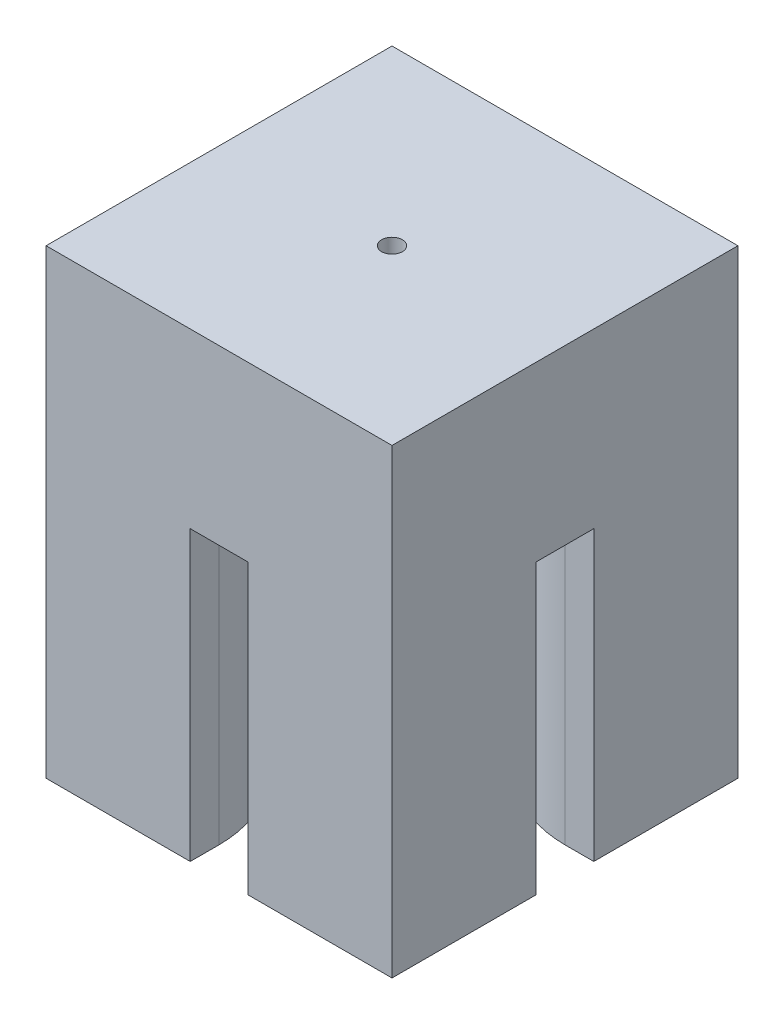
ISO-10303-21;
HEADER;
FILE_DESCRIPTION(('STEP AP214'),'2;1');
FILE_NAME('part.step','',(''),(''),'','','');
FILE_SCHEMA(('AUTOMOTIVE_DESIGN { 1 0 10303 214 1 1 1 1 }'));
ENDSEC;
DATA;
#1=APPLICATION_CONTEXT('core data for automotive mechanical design processes');
#2=APPLICATION_PROTOCOL_DEFINITION('international standard','automotive_design',2000,#1);
#3=PRODUCT_CONTEXT('',#1,'mechanical');
#4=PRODUCT('Part','Part','',(#3));
#5=PRODUCT_RELATED_PRODUCT_CATEGORY('part','',(#4));
#6=PRODUCT_DEFINITION_FORMATION('','',#4);
#7=PRODUCT_DEFINITION_CONTEXT('part definition',#1,'design');
#8=PRODUCT_DEFINITION('design','',#6,#7);
#9=PRODUCT_DEFINITION_SHAPE('','',#8);
#10=(LENGTH_UNIT() NAMED_UNIT(*) SI_UNIT(.MILLI.,.METRE.));
#11=(NAMED_UNIT(*) PLANE_ANGLE_UNIT() SI_UNIT($,.RADIAN.));
#12=(NAMED_UNIT(*) SI_UNIT($,.STERADIAN.) SOLID_ANGLE_UNIT());
#13=UNCERTAINTY_MEASURE_WITH_UNIT(LENGTH_MEASURE(1.E-05),#10,'distance_accuracy_value','');
#14=(GEOMETRIC_REPRESENTATION_CONTEXT(3) GLOBAL_UNCERTAINTY_ASSIGNED_CONTEXT((#13)) GLOBAL_UNIT_ASSIGNED_CONTEXT((#10,
#11,#12)) REPRESENTATION_CONTEXT('',''));
#15=CARTESIAN_POINT('',(0.,0.,0.));
#16=DIRECTION('',(0.,0.,1.));
#17=DIRECTION('',(1.,0.,0.));
#18=AXIS2_PLACEMENT_3D('',#15,#16,#17);
#19=CARTESIAN_POINT('',(0.,0.,0.));
#20=DIRECTION('',(0.,1.,0.));
#21=DIRECTION('',(0.,0.,1.));
#22=AXIS2_PLACEMENT_3D('',#19,#20,#21);
#23=PLANE('',#22);
#24=DIRECTION('',(0.,0.,-1.));
#25=VECTOR('',#24,1.);
#26=CARTESIAN_POINT('',(2.5,0.,15.001));
#27=LINE('',#26,#25);
#28=CARTESIAN_POINT('',(2.49999999999999,0.,15.));
#29=VERTEX_POINT('',#28);
#30=CARTESIAN_POINT('',(2.5,0.,12.5));
#31=VERTEX_POINT('',#30);
#32=EDGE_CURVE('E336',#29,#31,#27,.T.);
#33=ORIENTED_EDGE('',*,*,#32,.T.);
#34=CARTESIAN_POINT('',(12.5,0.,12.5));
#35=DIRECTION('',(0.,1.,0.));
#36=DIRECTION('',(0.,0.,1.));
#37=AXIS2_PLACEMENT_3D('',#34,#35,#36);
#38=CIRCLE('',#37,10.);
#39=CARTESIAN_POINT('',(12.5,0.,2.5));
#40=VERTEX_POINT('',#39);
#41=EDGE_CURVE('E188',#31,#40,#38,.F.);
#42=ORIENTED_EDGE('',*,*,#41,.T.);
#43=DIRECTION('',(1.,0.,0.));
#44=VECTOR('',#43,1.);
#45=CARTESIAN_POINT('',(-40.4950975679639,0.,2.50000000000001));
#46=LINE('',#45,#44);
#47=CARTESIAN_POINT('',(15.,0.,2.5));
#48=VERTEX_POINT('',#47);
#49=EDGE_CURVE('E182',#40,#48,#46,.T.);
#50=ORIENTED_EDGE('',*,*,#49,.T.);
#51=DIRECTION('',(0.,0.,-1.));
#52=VECTOR('',#51,1.);
#53=CARTESIAN_POINT('',(15.,0.,-15.));
#54=LINE('',#53,#52);
#55=CARTESIAN_POINT('',(15.,0.,15.));
#56=VERTEX_POINT('',#55);
#57=EDGE_CURVE('E187',#56,#48,#54,.T.);
#58=ORIENTED_EDGE('',*,*,#57,.F.);
#59=DIRECTION('',(1.,0.,0.));
#60=VECTOR('',#59,1.);
#61=CARTESIAN_POINT('',(-15.,0.,15.));
#62=LINE('',#61,#60);
#63=EDGE_CURVE('E231',#29,#56,#62,.T.);
#64=ORIENTED_EDGE('',*,*,#63,.F.);
#65=EDGE_LOOP('',(#33,#42,#50,#58,#64));
#66=FACE_BOUND('',#65,.T.);
#67=ADVANCED_FACE('F43',(#66),#23,.F.);
#68=CARTESIAN_POINT('',(-15.,0.,2.50000000000001));
#69=VERTEX_POINT('',#68);
#70=CARTESIAN_POINT('',(-12.5,0.,2.5));
#71=VERTEX_POINT('',#70);
#72=EDGE_CURVE('E192',#69,#71,#46,.T.);
#73=ORIENTED_EDGE('',*,*,#72,.T.);
#74=CARTESIAN_POINT('',(-12.5,0.,12.5));
#75=DIRECTION('',(0.,1.,0.));
#76=DIRECTION('',(0.,0.,1.));
#77=AXIS2_PLACEMENT_3D('',#74,#75,#76);
#78=CIRCLE('',#77,10.);
#79=CARTESIAN_POINT('',(-2.5,0.,12.5));
#80=VERTEX_POINT('',#79);
#81=EDGE_CURVE('E277',#71,#80,#78,.F.);
#82=ORIENTED_EDGE('',*,*,#81,.T.);
#83=DIRECTION('',(0.,0.,-1.));
#84=VECTOR('',#83,1.);
#85=CARTESIAN_POINT('',(-2.5,0.,15.001));
#86=LINE('',#85,#84);
#87=CARTESIAN_POINT('',(-2.50000000000001,0.,15.));
#88=VERTEX_POINT('',#87);
#89=EDGE_CURVE('E323',#88,#80,#86,.T.);
#90=ORIENTED_EDGE('',*,*,#89,.F.);
#91=CARTESIAN_POINT('',(-15.,0.,15.));
#92=VERTEX_POINT('',#91);
#93=EDGE_CURVE('E232',#92,#88,#62,.T.);
#94=ORIENTED_EDGE('',*,*,#93,.F.);
#95=DIRECTION('',(0.,0.,1.));
#96=VECTOR('',#95,1.);
#97=CARTESIAN_POINT('',(-15.,0.,-15.));
#98=LINE('',#97,#96);
#99=EDGE_CURVE('E226',#69,#92,#98,.T.);
#100=ORIENTED_EDGE('',*,*,#99,.F.);
#101=EDGE_LOOP('',(#73,#82,#90,#94,#100));
#102=FACE_BOUND('',#101,.T.);
#103=ADVANCED_FACE('F321',(#102),#23,.F.);
#104=CARTESIAN_POINT('',(2.5,25.,15.001));
#105=DIRECTION('',(1.,0.,0.));
#106=DIRECTION('',(0.,1.,0.));
#107=AXIS2_PLACEMENT_3D('',#104,#105,#106);
#108=PLANE('',#107);
#109=DIRECTION('',(0.,0.,-1.));
#110=VECTOR('',#109,1.);
#111=CARTESIAN_POINT('',(2.5,25.,15.001));
#112=LINE('',#111,#110);
#113=CARTESIAN_POINT('',(2.5,25.,15.));
#114=VERTEX_POINT('',#113);
#115=CARTESIAN_POINT('',(2.5,25.,12.5));
#116=VERTEX_POINT('',#115);
#117=EDGE_CURVE('E403',#114,#116,#112,.T.);
#118=ORIENTED_EDGE('',*,*,#117,.T.);
#119=DIRECTION('',(0.,-1.,0.));
#120=VECTOR('',#119,1.);
#121=CARTESIAN_POINT('',(2.5,25.,12.5));
#122=LINE('',#121,#120);
#123=EDGE_CURVE('E261',#116,#31,#122,.T.);
#124=ORIENTED_EDGE('',*,*,#123,.T.);
#125=ORIENTED_EDGE('',*,*,#32,.F.);
#126=DIRECTION('',(0.,1.,0.));
#127=VECTOR('',#126,1.);
#128=CARTESIAN_POINT('',(2.5,25.,15.));
#129=LINE('',#128,#127);
#130=EDGE_CURVE('E383',#29,#114,#129,.T.);
#131=ORIENTED_EDGE('',*,*,#130,.T.);
#132=EDGE_LOOP('',(#118,#124,#125,#131));
#133=FACE_BOUND('',#132,.T.);
#134=ADVANCED_FACE('F457',(#133),#108,.F.);
#135=CARTESIAN_POINT('',(-2.5,25.,15.001));
#136=DIRECTION('',(-1.,0.,0.));
#137=DIRECTION('',(0.,-1.,0.));
#138=AXIS2_PLACEMENT_3D('',#135,#136,#137);
#139=PLANE('',#138);
#140=ORIENTED_EDGE('',*,*,#89,.T.);
#141=DIRECTION('',(0.,1.,0.));
#142=VECTOR('',#141,1.);
#143=CARTESIAN_POINT('',(-2.5,25.,12.5));
#144=LINE('',#143,#142);
#145=CARTESIAN_POINT('',(-2.5,25.,12.5));
#146=VERTEX_POINT('',#145);
#147=EDGE_CURVE('E270',#80,#146,#144,.T.);
#148=ORIENTED_EDGE('',*,*,#147,.T.);
#149=DIRECTION('',(0.,0.,-1.));
#150=VECTOR('',#149,1.);
#151=CARTESIAN_POINT('',(-2.5,25.,15.001));
#152=LINE('',#151,#150);
#153=CARTESIAN_POINT('',(-2.5,25.,15.));
#154=VERTEX_POINT('',#153);
#155=EDGE_CURVE('E304',#154,#146,#152,.T.);
#156=ORIENTED_EDGE('',*,*,#155,.F.);
#157=DIRECTION('',(0.,-1.,0.));
#158=VECTOR('',#157,1.);
#159=CARTESIAN_POINT('',(-2.5,25.,15.));
#160=LINE('',#159,#158);
#161=EDGE_CURVE('E328',#154,#88,#160,.T.);
#162=ORIENTED_EDGE('',*,*,#161,.T.);
#163=EDGE_LOOP('',(#140,#148,#156,#162));
#164=FACE_BOUND('',#163,.T.);
#165=ADVANCED_FACE('F326',(#164),#139,.F.);
#166=DIRECTION('',(1.,0.,0.));
#167=VECTOR('',#166,1.);
#168=CARTESIAN_POINT('',(-40.4950975679639,0.,-2.49999999999999));
#169=LINE('',#168,#167);
#170=CARTESIAN_POINT('',(12.5,0.,-2.5));
#171=VERTEX_POINT('',#170);
#172=CARTESIAN_POINT('',(15.,0.,-2.5));
#173=VERTEX_POINT('',#172);
#174=EDGE_CURVE('E438',#171,#173,#169,.T.);
#175=ORIENTED_EDGE('',*,*,#174,.F.);
#176=CARTESIAN_POINT('',(12.5,0.,-12.5));
#177=DIRECTION('',(0.,1.,0.));
#178=DIRECTION('',(0.,0.,1.));
#179=AXIS2_PLACEMENT_3D('',#176,#177,#178);
#180=CIRCLE('',#179,10.);
#181=CARTESIAN_POINT('',(2.5,0.,-12.5));
#182=VERTEX_POINT('',#181);
#183=EDGE_CURVE('E258',#171,#182,#180,.F.);
#184=ORIENTED_EDGE('',*,*,#183,.T.);
#185=CARTESIAN_POINT('',(2.5,0.,-15.));
#186=VERTEX_POINT('',#185);
#187=EDGE_CURVE('E341',#182,#186,#27,.T.);
#188=ORIENTED_EDGE('',*,*,#187,.T.);
#189=DIRECTION('',(-1.,0.,0.));
#190=VECTOR('',#189,1.);
#191=CARTESIAN_POINT('',(-15.,0.,-15.));
#192=LINE('',#191,#190);
#193=CARTESIAN_POINT('',(15.,0.,-15.));
#194=VERTEX_POINT('',#193);
#195=EDGE_CURVE('E217',#194,#186,#192,.T.);
#196=ORIENTED_EDGE('',*,*,#195,.F.);
#197=EDGE_CURVE('E213',#173,#194,#54,.T.);
#198=ORIENTED_EDGE('',*,*,#197,.F.);
#199=EDGE_LOOP('',(#175,#184,#188,#196,#198));
#200=FACE_BOUND('',#199,.T.);
#201=ADVANCED_FACE('F448',(#200),#23,.F.);
#202=CARTESIAN_POINT('',(15.,40.,-15.));
#203=DIRECTION('',(-1.,0.,0.));
#204=DIRECTION('',(0.,0.,1.));
#205=AXIS2_PLACEMENT_3D('',#202,#203,#204);
#206=PLANE('',#205);
#207=ORIENTED_EDGE('',*,*,#57,.T.);
#208=DIRECTION('',(0.,-1.,0.));
#209=VECTOR('',#208,1.);
#210=CARTESIAN_POINT('',(15.,0.,2.5));
#211=LINE('',#210,#209);
#212=CARTESIAN_POINT('',(15.,25.,2.50000000000001));
#213=VERTEX_POINT('',#212);
#214=EDGE_CURVE('E196',#213,#48,#211,.T.);
#215=ORIENTED_EDGE('',*,*,#214,.F.);
#216=DIRECTION('',(0.,0.,1.));
#217=VECTOR('',#216,1.);
#218=CARTESIAN_POINT('',(15.,25.,2.50000000000001));
#219=LINE('',#218,#217);
#220=CARTESIAN_POINT('',(15.,25.,-2.5));
#221=VERTEX_POINT('',#220);
#222=EDGE_CURVE('E193',#221,#213,#219,.T.);
#223=ORIENTED_EDGE('',*,*,#222,.F.);
#224=DIRECTION('',(0.,1.,0.));
#225=VECTOR('',#224,1.);
#226=CARTESIAN_POINT('',(15.,0.,-2.5));
#227=LINE('',#226,#225);
#228=EDGE_CURVE('E204',#173,#221,#227,.T.);
#229=ORIENTED_EDGE('',*,*,#228,.F.);
#230=ORIENTED_EDGE('',*,*,#197,.T.);
#231=DIRECTION('',(0.,-1.,0.));
#232=VECTOR('',#231,1.);
#233=CARTESIAN_POINT('',(15.,40.,-15.));
#234=LINE('',#233,#232);
#235=CARTESIAN_POINT('',(15.,40.,-15.));
#236=VERTEX_POINT('',#235);
#237=EDGE_CURVE('E247',#236,#194,#234,.T.);
#238=ORIENTED_EDGE('',*,*,#237,.F.);
#239=DIRECTION('',(0.,0.,-1.));
#240=VECTOR('',#239,1.);
#241=CARTESIAN_POINT('',(15.,40.,-15.));
#242=LINE('',#241,#240);
#243=CARTESIAN_POINT('',(15.,40.,15.));
#244=VERTEX_POINT('',#243);
#245=EDGE_CURVE('E236',#244,#236,#242,.T.);
#246=ORIENTED_EDGE('',*,*,#245,.F.);
#247=DIRECTION('',(0.,-1.,0.));
#248=VECTOR('',#247,1.);
#249=CARTESIAN_POINT('',(15.,40.,15.));
#250=LINE('',#249,#248);
#251=EDGE_CURVE('E210',#244,#56,#250,.T.);
#252=ORIENTED_EDGE('',*,*,#251,.T.);
#253=EDGE_LOOP('',(#207,#215,#223,#229,#230,#238,#246,#252));
#254=FACE_BOUND('',#253,.T.);
#255=ADVANCED_FACE('F207',(#254),#206,.F.);
#256=CARTESIAN_POINT('',(-15.,40.,-15.));
#257=DIRECTION('',(0.,0.,1.));
#258=DIRECTION('',(1.,0.,0.));
#259=AXIS2_PLACEMENT_3D('',#256,#257,#258);
#260=PLANE('',#259);
#261=ORIENTED_EDGE('',*,*,#195,.T.);
#262=DIRECTION('',(0.,-1.,0.));
#263=VECTOR('',#262,1.);
#264=CARTESIAN_POINT('',(2.5,25.,-15.));
#265=LINE('',#264,#263);
#266=CARTESIAN_POINT('',(2.5,25.,-15.));
#267=VERTEX_POINT('',#266);
#268=EDGE_CURVE('E392',#267,#186,#265,.T.);
#269=ORIENTED_EDGE('',*,*,#268,.F.);
#270=DIRECTION('',(1.,0.,0.));
#271=VECTOR('',#270,1.);
#272=CARTESIAN_POINT('',(2.5,25.,-15.));
#273=LINE('',#272,#271);
#274=CARTESIAN_POINT('',(-2.5,25.,-15.));
#275=VERTEX_POINT('',#274);
#276=EDGE_CURVE('E400',#275,#267,#273,.T.);
#277=ORIENTED_EDGE('',*,*,#276,.F.);
#278=DIRECTION('',(0.,1.,0.));
#279=VECTOR('',#278,1.);
#280=CARTESIAN_POINT('',(-2.5,25.,-15.));
#281=LINE('',#280,#279);
#282=CARTESIAN_POINT('',(-2.5,0.,-15.));
#283=VERTEX_POINT('',#282);
#284=EDGE_CURVE('E396',#283,#275,#281,.T.);
#285=ORIENTED_EDGE('',*,*,#284,.F.);
#286=CARTESIAN_POINT('',(-15.,0.,-15.));
#287=VERTEX_POINT('',#286);
#288=EDGE_CURVE('E212',#283,#287,#192,.T.);
#289=ORIENTED_EDGE('',*,*,#288,.T.);
#290=DIRECTION('',(0.,-1.,0.));
#291=VECTOR('',#290,1.);
#292=CARTESIAN_POINT('',(-15.,40.,-15.));
#293=LINE('',#292,#291);
#294=CARTESIAN_POINT('',(-15.,40.,-15.));
#295=VERTEX_POINT('',#294);
#296=EDGE_CURVE('E243',#295,#287,#293,.T.);
#297=ORIENTED_EDGE('',*,*,#296,.F.);
#298=DIRECTION('',(-1.,0.,0.));
#299=VECTOR('',#298,1.);
#300=CARTESIAN_POINT('',(-15.,40.,-15.));
#301=LINE('',#300,#299);
#302=EDGE_CURVE('E349',#236,#295,#301,.T.);
#303=ORIENTED_EDGE('',*,*,#302,.F.);
#304=ORIENTED_EDGE('',*,*,#237,.T.);
#305=EDGE_LOOP('',(#261,#269,#277,#285,#289,#297,#303,#304));
#306=FACE_BOUND('',#305,.T.);
#307=ADVANCED_FACE('F368',(#306),#260,.F.);
#308=CARTESIAN_POINT('',(-15.,40.,-15.));
#309=DIRECTION('',(1.,0.,0.));
#310=DIRECTION('',(0.,0.,-1.));
#311=AXIS2_PLACEMENT_3D('',#308,#309,#310);
#312=PLANE('',#311);
#313=DIRECTION('',(0.,0.,-1.));
#314=VECTOR('',#313,1.);
#315=CARTESIAN_POINT('',(-15.,25.,2.50000000000001));
#316=LINE('',#315,#314);
#317=CARTESIAN_POINT('',(-15.,25.,2.50000000000002));
#318=VERTEX_POINT('',#317);
#319=CARTESIAN_POINT('',(-15.,25.,-2.5));
#320=VERTEX_POINT('',#319);
#321=EDGE_CURVE('E385',#318,#320,#316,.T.);
#322=ORIENTED_EDGE('',*,*,#321,.F.);
#323=DIRECTION('',(0.,1.,0.));
#324=VECTOR('',#323,1.);
#325=CARTESIAN_POINT('',(-15.,0.,2.5));
#326=LINE('',#325,#324);
#327=EDGE_CURVE('E312',#69,#318,#326,.T.);
#328=ORIENTED_EDGE('',*,*,#327,.F.);
#329=ORIENTED_EDGE('',*,*,#99,.T.);
#330=DIRECTION('',(0.,-1.,0.));
#331=VECTOR('',#330,1.);
#332=CARTESIAN_POINT('',(-15.,40.,15.));
#333=LINE('',#332,#331);
#334=CARTESIAN_POINT('',(-15.,40.,15.));
#335=VERTEX_POINT('',#334);
#336=EDGE_CURVE('E239',#335,#92,#333,.T.);
#337=ORIENTED_EDGE('',*,*,#336,.F.);
#338=DIRECTION('',(0.,0.,1.));
#339=VECTOR('',#338,1.);
#340=CARTESIAN_POINT('',(-15.,40.,-15.));
#341=LINE('',#340,#339);
#342=EDGE_CURVE('E351',#295,#335,#341,.T.);
#343=ORIENTED_EDGE('',*,*,#342,.F.);
#344=ORIENTED_EDGE('',*,*,#296,.T.);
#345=CARTESIAN_POINT('',(-15.,0.,-2.5));
#346=VERTEX_POINT('',#345);
#347=EDGE_CURVE('E227',#287,#346,#98,.T.);
#348=ORIENTED_EDGE('',*,*,#347,.T.);
#349=DIRECTION('',(0.,-1.,0.));
#350=VECTOR('',#349,1.);
#351=CARTESIAN_POINT('',(-15.,0.,-2.5));
#352=LINE('',#351,#350);
#353=EDGE_CURVE('E314',#320,#346,#352,.T.);
#354=ORIENTED_EDGE('',*,*,#353,.F.);
#355=EDGE_LOOP('',(#322,#328,#329,#337,#343,#344,#348,#354));
#356=FACE_BOUND('',#355,.T.);
#357=ADVANCED_FACE('F375',(#356),#312,.F.);
#358=CARTESIAN_POINT('',(-15.,40.,15.));
#359=DIRECTION('',(0.,0.,-1.));
#360=DIRECTION('',(-1.,0.,0.));
#361=AXIS2_PLACEMENT_3D('',#358,#359,#360);
#362=PLANE('',#361);
#363=DIRECTION('',(-1.,0.,0.));
#364=VECTOR('',#363,1.);
#365=CARTESIAN_POINT('',(2.5,25.,15.));
#366=LINE('',#365,#364);
#367=EDGE_CURVE('E378',#114,#154,#366,.T.);
#368=ORIENTED_EDGE('',*,*,#367,.F.);
#369=ORIENTED_EDGE('',*,*,#130,.F.);
#370=ORIENTED_EDGE('',*,*,#63,.T.);
#371=ORIENTED_EDGE('',*,*,#251,.F.);
#372=DIRECTION('',(1.,0.,0.));
#373=VECTOR('',#372,1.);
#374=CARTESIAN_POINT('',(-15.,40.,15.));
#375=LINE('',#374,#373);
#376=EDGE_CURVE('E221',#335,#244,#375,.T.);
#377=ORIENTED_EDGE('',*,*,#376,.F.);
#378=ORIENTED_EDGE('',*,*,#336,.T.);
#379=ORIENTED_EDGE('',*,*,#93,.T.);
#380=ORIENTED_EDGE('',*,*,#161,.F.);
#381=EDGE_LOOP('',(#368,#369,#370,#371,#377,#378,#379,#380));
#382=FACE_BOUND('',#381,.T.);
#383=ADVANCED_FACE('F362',(#382),#362,.F.);
#384=CARTESIAN_POINT('',(0.,40.,0.));
#385=DIRECTION('',(0.,1.,0.));
#386=DIRECTION('',(0.,0.,1.));
#387=AXIS2_PLACEMENT_3D('',#384,#385,#386);
#388=PLANE('',#387);
#389=CARTESIAN_POINT('',(0.,40.,0.));
#390=DIRECTION('',(0.,1.,0.));
#391=DIRECTION('',(0.,0.,1.));
#392=AXIS2_PLACEMENT_3D('',#389,#390,#391);
#393=CIRCLE('',#392,0.9);
#394=CARTESIAN_POINT('',(0.,40.,0.9));
#395=VERTEX_POINT('',#394);
#396=EDGE_CURVE('E219',#395,#395,#393,.T.);
#397=ORIENTED_EDGE('',*,*,#396,.F.);
#398=EDGE_LOOP('',(#397));
#399=FACE_BOUND('',#398,.T.);
#400=ORIENTED_EDGE('',*,*,#245,.T.);
#401=ORIENTED_EDGE('',*,*,#302,.T.);
#402=ORIENTED_EDGE('',*,*,#342,.T.);
#403=ORIENTED_EDGE('',*,*,#376,.T.);
#404=EDGE_LOOP('',(#400,#401,#402,#403));
#405=FACE_BOUND('',#404,.T.);
#406=ADVANCED_FACE('F358',(#399,#405),#388,.T.);
#407=CARTESIAN_POINT('',(-2.5,0.,-12.5));
#408=VERTEX_POINT('',#407);
#409=EDGE_CURVE('E331',#408,#283,#86,.T.);
#410=ORIENTED_EDGE('',*,*,#409,.F.);
#411=CARTESIAN_POINT('',(-12.5,0.,-12.5));
#412=DIRECTION('',(0.,1.,0.));
#413=DIRECTION('',(0.,0.,1.));
#414=AXIS2_PLACEMENT_3D('',#411,#412,#413);
#415=CIRCLE('',#414,10.);
#416=CARTESIAN_POINT('',(-12.5,0.,-2.5));
#417=VERTEX_POINT('',#416);
#418=EDGE_CURVE('E67',#408,#417,#415,.F.);
#419=ORIENTED_EDGE('',*,*,#418,.T.);
#420=EDGE_CURVE('E421',#346,#417,#169,.T.);
#421=ORIENTED_EDGE('',*,*,#420,.F.);
#422=ORIENTED_EDGE('',*,*,#347,.F.);
#423=ORIENTED_EDGE('',*,*,#288,.F.);
#424=EDGE_LOOP('',(#410,#419,#421,#422,#423));
#425=FACE_BOUND('',#424,.T.);
#426=ADVANCED_FACE('F420',(#425),#23,.F.);
#427=CARTESIAN_POINT('',(0.,-0.001000000000001,0.));
#428=DIRECTION('',(0.,1.,0.));
#429=DIRECTION('',(0.,0.,1.));
#430=AXIS2_PLACEMENT_3D('',#427,#428,#429);
#431=CYLINDRICAL_SURFACE('',#430,0.9);
#432=CARTESIAN_POINT('',(0.,25.,0.));
#433=DIRECTION('',(0.,1.,0.));
#434=DIRECTION('',(0.,0.,1.));
#435=AXIS2_PLACEMENT_3D('',#432,#433,#434);
#436=CIRCLE('',#435,0.9);
#437=CARTESIAN_POINT('',(0.,25.,0.9));
#438=VERTEX_POINT('',#437);
#439=EDGE_CURVE('E345',#438,#438,#436,.T.);
#440=ORIENTED_EDGE('',*,*,#439,.F.);
#441=EDGE_LOOP('',(#440));
#442=FACE_BOUND('',#441,.T.);
#443=ORIENTED_EDGE('',*,*,#396,.T.);
#444=EDGE_LOOP('',(#443));
#445=FACE_BOUND('',#444,.T.);
#446=ADVANCED_FACE('F469',(#442,#445),#431,.F.);
#447=ORIENTED_EDGE('',*,*,#187,.F.);
#448=DIRECTION('',(0.,1.,0.));
#449=VECTOR('',#448,1.);
#450=CARTESIAN_POINT('',(2.5,25.,-12.5));
#451=LINE('',#450,#449);
#452=CARTESIAN_POINT('',(2.5,25.,-12.5));
#453=VERTEX_POINT('',#452);
#454=EDGE_CURVE('E251',#182,#453,#451,.T.);
#455=ORIENTED_EDGE('',*,*,#454,.T.);
#456=EDGE_CURVE('E406',#453,#267,#112,.T.);
#457=ORIENTED_EDGE('',*,*,#456,.T.);
#458=ORIENTED_EDGE('',*,*,#268,.T.);
#459=EDGE_LOOP('',(#447,#455,#457,#458));
#460=FACE_BOUND('',#459,.T.);
#461=ADVANCED_FACE('F415',(#460),#108,.F.);
#462=CARTESIAN_POINT('',(-2.5,25.,-12.5));
#463=VERTEX_POINT('',#462);
#464=EDGE_CURVE('E330',#463,#275,#152,.T.);
#465=ORIENTED_EDGE('',*,*,#464,.F.);
#466=DIRECTION('',(0.,-1.,0.));
#467=VECTOR('',#466,1.);
#468=CARTESIAN_POINT('',(-2.5,25.,-12.5));
#469=LINE('',#468,#467);
#470=EDGE_CURVE('E280',#463,#408,#469,.T.);
#471=ORIENTED_EDGE('',*,*,#470,.T.);
#472=ORIENTED_EDGE('',*,*,#409,.T.);
#473=ORIENTED_EDGE('',*,*,#284,.T.);
#474=EDGE_LOOP('',(#465,#471,#472,#473));
#475=FACE_BOUND('',#474,.T.);
#476=ADVANCED_FACE('F465',(#475),#139,.F.);
#477=CARTESIAN_POINT('',(2.5,25.,15.001));
#478=DIRECTION('',(0.,1.,0.));
#479=DIRECTION('',(0.,0.,1.));
#480=AXIS2_PLACEMENT_3D('',#477,#478,#479);
#481=PLANE('',#480);
#482=ORIENTED_EDGE('',*,*,#456,.F.);
#483=CARTESIAN_POINT('',(12.5,25.,-12.5));
#484=DIRECTION('',(0.,1.,0.));
#485=DIRECTION('',(0.,0.,1.));
#486=AXIS2_PLACEMENT_3D('',#483,#484,#485);
#487=CIRCLE('',#486,10.);
#488=CARTESIAN_POINT('',(12.5,25.,-2.5));
#489=VERTEX_POINT('',#488);
#490=EDGE_CURVE('E288',#453,#489,#487,.T.);
#491=ORIENTED_EDGE('',*,*,#490,.T.);
#492=DIRECTION('',(1.,0.,0.));
#493=VECTOR('',#492,1.);
#494=CARTESIAN_POINT('',(-40.4950975679639,25.,-2.49999999999999));
#495=LINE('',#494,#493);
#496=EDGE_CURVE('E436',#489,#221,#495,.T.);
#497=ORIENTED_EDGE('',*,*,#496,.T.);
#498=ORIENTED_EDGE('',*,*,#222,.T.);
#499=DIRECTION('',(1.,0.,0.));
#500=VECTOR('',#499,1.);
#501=CARTESIAN_POINT('',(-40.4950975679639,25.,2.50000000000002));
#502=LINE('',#501,#500);
#503=CARTESIAN_POINT('',(12.5,25.,2.50000000000001));
#504=VERTEX_POINT('',#503);
#505=EDGE_CURVE('E199',#504,#213,#502,.T.);
#506=ORIENTED_EDGE('',*,*,#505,.F.);
#507=CARTESIAN_POINT('',(12.5,25.,12.5));
#508=DIRECTION('',(0.,1.,0.));
#509=DIRECTION('',(0.,0.,1.));
#510=AXIS2_PLACEMENT_3D('',#507,#508,#509);
#511=CIRCLE('',#510,10.);
#512=EDGE_CURVE('E291',#504,#116,#511,.T.);
#513=ORIENTED_EDGE('',*,*,#512,.T.);
#514=ORIENTED_EDGE('',*,*,#117,.F.);
#515=ORIENTED_EDGE('',*,*,#367,.T.);
#516=ORIENTED_EDGE('',*,*,#155,.T.);
#517=CARTESIAN_POINT('',(-12.5,25.,12.5));
#518=DIRECTION('',(0.,1.,0.));
#519=DIRECTION('',(0.,0.,1.));
#520=AXIS2_PLACEMENT_3D('',#517,#518,#519);
#521=CIRCLE('',#520,10.);
#522=CARTESIAN_POINT('',(-12.5,25.,2.50000000000001));
#523=VERTEX_POINT('',#522);
#524=EDGE_CURVE('E52',#146,#523,#521,.T.);
#525=ORIENTED_EDGE('',*,*,#524,.T.);
#526=EDGE_CURVE('E301',#318,#523,#502,.T.);
#527=ORIENTED_EDGE('',*,*,#526,.F.);
#528=ORIENTED_EDGE('',*,*,#321,.T.);
#529=CARTESIAN_POINT('',(-12.5,25.,-2.5));
#530=VERTEX_POINT('',#529);
#531=EDGE_CURVE('E433',#320,#530,#495,.T.);
#532=ORIENTED_EDGE('',*,*,#531,.T.);
#533=CARTESIAN_POINT('',(-12.5,25.,-12.5));
#534=DIRECTION('',(0.,1.,0.));
#535=DIRECTION('',(0.,0.,1.));
#536=AXIS2_PLACEMENT_3D('',#533,#534,#535);
#537=CIRCLE('',#536,10.);
#538=EDGE_CURVE('E11',#530,#463,#537,.T.);
#539=ORIENTED_EDGE('',*,*,#538,.T.);
#540=ORIENTED_EDGE('',*,*,#464,.T.);
#541=ORIENTED_EDGE('',*,*,#276,.T.);
#542=EDGE_LOOP('',(#482,#491,#497,#498,#506,#513,#514,#515,#516,#525,#527,#528,#532,#539,#540,#541));
#543=FACE_BOUND('',#542,.T.);
#544=ORIENTED_EDGE('',*,*,#439,.T.);
#545=EDGE_LOOP('',(#544));
#546=FACE_BOUND('',#545,.T.);
#547=ADVANCED_FACE('F299',(#543,#546),#481,.F.);
#548=CARTESIAN_POINT('',(-40.4950975679639,0.,-2.49999999999999));
#549=DIRECTION('',(0.,0.,-1.));
#550=DIRECTION('',(-1.,0.,0.));
#551=AXIS2_PLACEMENT_3D('',#548,#549,#550);
#552=PLANE('',#551);
#553=ORIENTED_EDGE('',*,*,#420,.T.);
#554=DIRECTION('',(0.,-1.,0.));
#555=VECTOR('',#554,1.);
#556=CARTESIAN_POINT('',(-12.5,0.,-2.5));
#557=LINE('',#556,#555);
#558=EDGE_CURVE('E59',#417,#530,#557,.F.);
#559=ORIENTED_EDGE('',*,*,#558,.T.);
#560=ORIENTED_EDGE('',*,*,#531,.F.);
#561=ORIENTED_EDGE('',*,*,#353,.T.);
#562=EDGE_LOOP('',(#553,#559,#560,#561));
#563=FACE_BOUND('',#562,.T.);
#564=ADVANCED_FACE('F509',(#563),#552,.F.);
#565=CARTESIAN_POINT('',(-40.4950975679639,0.,2.50000000000001));
#566=DIRECTION('',(0.,0.,1.));
#567=DIRECTION('',(0.,-1.,0.));
#568=AXIS2_PLACEMENT_3D('',#565,#566,#567);
#569=PLANE('',#568);
#570=ORIENTED_EDGE('',*,*,#526,.T.);
#571=DIRECTION('',(0.,1.,0.));
#572=VECTOR('',#571,1.);
#573=CARTESIAN_POINT('',(-12.5,0.,2.5));
#574=LINE('',#573,#572);
#575=EDGE_CURVE('E274',#523,#71,#574,.F.);
#576=ORIENTED_EDGE('',*,*,#575,.T.);
#577=ORIENTED_EDGE('',*,*,#72,.F.);
#578=ORIENTED_EDGE('',*,*,#327,.T.);
#579=EDGE_LOOP('',(#570,#576,#577,#578));
#580=FACE_BOUND('',#579,.T.);
#581=ADVANCED_FACE('F309',(#580),#569,.F.);
#582=ORIENTED_EDGE('',*,*,#49,.F.);
#583=DIRECTION('',(0.,-1.,0.));
#584=VECTOR('',#583,1.);
#585=CARTESIAN_POINT('',(12.5,0.,2.5));
#586=LINE('',#585,#584);
#587=EDGE_CURVE('E267',#40,#504,#586,.F.);
#588=ORIENTED_EDGE('',*,*,#587,.T.);
#589=ORIENTED_EDGE('',*,*,#505,.T.);
#590=ORIENTED_EDGE('',*,*,#214,.T.);
#591=EDGE_LOOP('',(#582,#588,#589,#590));
#592=FACE_BOUND('',#591,.T.);
#593=ADVANCED_FACE('F197',(#592),#569,.F.);
#594=ORIENTED_EDGE('',*,*,#496,.F.);
#595=DIRECTION('',(0.,1.,0.));
#596=VECTOR('',#595,1.);
#597=CARTESIAN_POINT('',(12.5,0.,-2.5));
#598=LINE('',#597,#596);
#599=EDGE_CURVE('E255',#489,#171,#598,.F.);
#600=ORIENTED_EDGE('',*,*,#599,.T.);
#601=ORIENTED_EDGE('',*,*,#174,.T.);
#602=ORIENTED_EDGE('',*,*,#228,.T.);
#603=EDGE_LOOP('',(#594,#600,#601,#602));
#604=FACE_BOUND('',#603,.T.);
#605=ADVANCED_FACE('F444',(#604),#552,.F.);
#606=CARTESIAN_POINT('',(12.5,25.,-12.5));
#607=DIRECTION('',(0.,1.,0.));
#608=DIRECTION('',(-1.,0.,0.));
#609=AXIS2_PLACEMENT_3D('',#606,#607,#608);
#610=CYLINDRICAL_SURFACE('',#609,10.);
#611=ORIENTED_EDGE('',*,*,#183,.F.);
#612=ORIENTED_EDGE('',*,*,#599,.F.);
#613=ORIENTED_EDGE('',*,*,#490,.F.);
#614=ORIENTED_EDGE('',*,*,#454,.F.);
#615=EDGE_LOOP('',(#611,#612,#613,#614));
#616=FACE_BOUND('',#615,.T.);
#617=ADVANCED_FACE('F451',(#616),#610,.T.);
#618=CARTESIAN_POINT('',(12.5,25.,12.5));
#619=DIRECTION('',(0.,-1.,0.));
#620=DIRECTION('',(0.,0.,-1.));
#621=AXIS2_PLACEMENT_3D('',#618,#619,#620);
#622=CYLINDRICAL_SURFACE('',#621,10.);
#623=ORIENTED_EDGE('',*,*,#512,.F.);
#624=ORIENTED_EDGE('',*,*,#587,.F.);
#625=ORIENTED_EDGE('',*,*,#41,.F.);
#626=ORIENTED_EDGE('',*,*,#123,.F.);
#627=EDGE_LOOP('',(#623,#624,#625,#626));
#628=FACE_BOUND('',#627,.T.);
#629=ADVANCED_FACE('F456',(#628),#622,.T.);
#630=CARTESIAN_POINT('',(-12.5,25.,12.5));
#631=DIRECTION('',(0.,1.,0.));
#632=DIRECTION('',(0.,0.,1.));
#633=AXIS2_PLACEMENT_3D('',#630,#631,#632);
#634=CYLINDRICAL_SURFACE('',#633,10.);
#635=ORIENTED_EDGE('',*,*,#81,.F.);
#636=ORIENTED_EDGE('',*,*,#575,.F.);
#637=ORIENTED_EDGE('',*,*,#524,.F.);
#638=ORIENTED_EDGE('',*,*,#147,.F.);
#639=EDGE_LOOP('',(#635,#636,#637,#638));
#640=FACE_BOUND('',#639,.T.);
#641=ADVANCED_FACE('F317',(#640),#634,.T.);
#642=CARTESIAN_POINT('',(-12.5,25.,-12.5));
#643=DIRECTION('',(0.,-1.,0.));
#644=DIRECTION('',(1.,0.,0.));
#645=AXIS2_PLACEMENT_3D('',#642,#643,#644);
#646=CYLINDRICAL_SURFACE('',#645,10.);
#647=ORIENTED_EDGE('',*,*,#538,.F.);
#648=ORIENTED_EDGE('',*,*,#558,.F.);
#649=ORIENTED_EDGE('',*,*,#418,.F.);
#650=ORIENTED_EDGE('',*,*,#470,.F.);
#651=EDGE_LOOP('',(#647,#648,#649,#650));
#652=FACE_BOUND('',#651,.T.);
#653=ADVANCED_FACE('F45',(#652),#646,.T.);
#654=CLOSED_SHELL('',(#67,#103,#134,#165,#201,#255,#307,#357,#383,#406,#426,#446,#461,#476,#547,
#564,#581,#593,#605,#617,#629,#641,#653));
#655=MANIFOLD_SOLID_BREP('B2',#654);
#656=ADVANCED_BREP_SHAPE_REPRESENTATION('',(#18,#655),#14);
#657=SHAPE_DEFINITION_REPRESENTATION(#9,#656);
ENDSEC;
END-ISO-10303-21;
